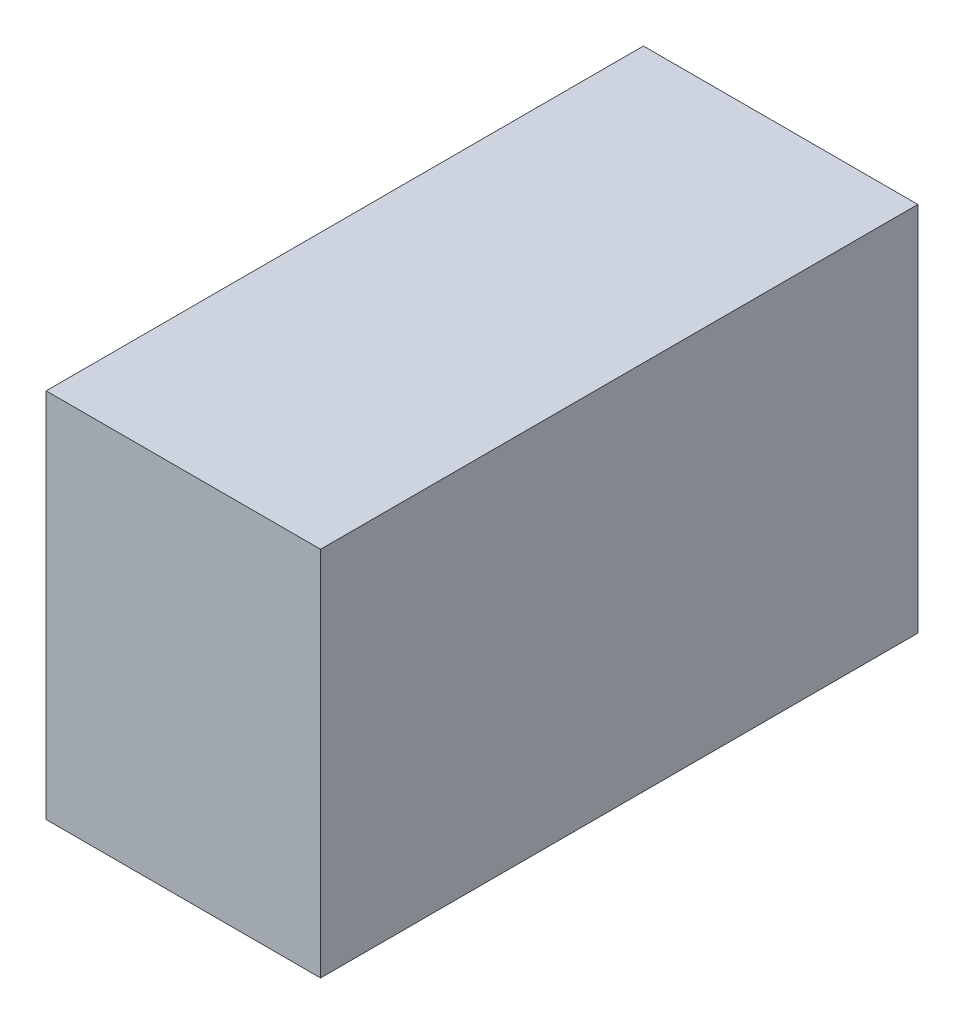
ISO-10303-21;
HEADER;
FILE_DESCRIPTION(('STEP AP214'),'2;1');
FILE_NAME('part.step','',(''),(''),'','','');
FILE_SCHEMA(('AUTOMOTIVE_DESIGN { 1 0 10303 214 1 1 1 1 }'));
ENDSEC;
DATA;
#1=APPLICATION_CONTEXT('core data for automotive mechanical design processes');
#2=APPLICATION_PROTOCOL_DEFINITION('international standard','automotive_design',2000,#1);
#3=PRODUCT_CONTEXT('',#1,'mechanical');
#4=PRODUCT('Part','Part','',(#3));
#5=PRODUCT_RELATED_PRODUCT_CATEGORY('part','',(#4));
#6=PRODUCT_DEFINITION_FORMATION('','',#4);
#7=PRODUCT_DEFINITION_CONTEXT('part definition',#1,'design');
#8=PRODUCT_DEFINITION('design','',#6,#7);
#9=PRODUCT_DEFINITION_SHAPE('','',#8);
#10=(LENGTH_UNIT() NAMED_UNIT(*) SI_UNIT(.MILLI.,.METRE.));
#11=(NAMED_UNIT(*) PLANE_ANGLE_UNIT() SI_UNIT($,.RADIAN.));
#12=(NAMED_UNIT(*) SI_UNIT($,.STERADIAN.) SOLID_ANGLE_UNIT());
#13=UNCERTAINTY_MEASURE_WITH_UNIT(LENGTH_MEASURE(1.E-05),#10,'distance_accuracy_value','');
#14=(GEOMETRIC_REPRESENTATION_CONTEXT(3) GLOBAL_UNCERTAINTY_ASSIGNED_CONTEXT((#13)) GLOBAL_UNIT_ASSIGNED_CONTEXT((#10,
#11,#12)) REPRESENTATION_CONTEXT('',''));
#15=CARTESIAN_POINT('',(0.,0.,0.));
#16=DIRECTION('',(0.,0.,1.));
#17=DIRECTION('',(1.,0.,0.));
#18=AXIS2_PLACEMENT_3D('',#15,#16,#17);
#19=CARTESIAN_POINT('',(-67.75,46.,-79.0875));
#20=DIRECTION('',(-1.,0.,0.));
#21=DIRECTION('',(0.,0.,1.));
#22=AXIS2_PLACEMENT_3D('',#19,#20,#21);
#23=PLANE('',#22);
#24=DIRECTION('',(0.,0.,-1.));
#25=VECTOR('',#24,1.);
#26=CARTESIAN_POINT('',(-67.75,0.,-79.0875));
#27=LINE('',#26,#25);
#28=CARTESIAN_POINT('',(-67.75,0.,-5.08749999999999));
#29=VERTEX_POINT('',#28);
#30=CARTESIAN_POINT('',(-67.75,0.,-79.0875));
#31=VERTEX_POINT('',#30);
#32=EDGE_CURVE('E98',#29,#31,#27,.T.);
#33=ORIENTED_EDGE('',*,*,#32,.T.);
#34=DIRECTION('',(0.,-1.,0.));
#35=VECTOR('',#34,1.);
#36=CARTESIAN_POINT('',(-67.75,46.,-79.0875));
#37=LINE('',#36,#35);
#38=CARTESIAN_POINT('',(-67.75,46.,-79.0875));
#39=VERTEX_POINT('',#38);
#40=EDGE_CURVE('E11',#39,#31,#37,.T.);
#41=ORIENTED_EDGE('',*,*,#40,.F.);
#42=DIRECTION('',(0.,0.,-1.));
#43=VECTOR('',#42,1.);
#44=CARTESIAN_POINT('',(-67.75,46.,-79.0875));
#45=LINE('',#44,#43);
#46=CARTESIAN_POINT('',(-67.75,46.,-5.08749999999999));
#47=VERTEX_POINT('',#46);
#48=EDGE_CURVE('E86',#47,#39,#45,.T.);
#49=ORIENTED_EDGE('',*,*,#48,.F.);
#50=DIRECTION('',(0.,-1.,0.));
#51=VECTOR('',#50,1.);
#52=CARTESIAN_POINT('',(-67.75,46.,-5.08749999999999));
#53=LINE('',#52,#51);
#54=EDGE_CURVE('E94',#47,#29,#53,.T.);
#55=ORIENTED_EDGE('',*,*,#54,.T.);
#56=EDGE_LOOP('',(#33,#41,#49,#55));
#57=FACE_BOUND('',#56,.T.);
#58=ADVANCED_FACE('F35',(#57),#23,.F.);
#59=CARTESIAN_POINT('',(-101.75,46.,-79.0875));
#60=DIRECTION('',(0.,0.,1.));
#61=DIRECTION('',(1.,0.,0.));
#62=AXIS2_PLACEMENT_3D('',#59,#60,#61);
#63=PLANE('',#62);
#64=DIRECTION('',(-1.,0.,0.));
#65=VECTOR('',#64,1.);
#66=CARTESIAN_POINT('',(-101.75,0.,-79.0875));
#67=LINE('',#66,#65);
#68=CARTESIAN_POINT('',(-101.75,0.,-79.0875));
#69=VERTEX_POINT('',#68);
#70=EDGE_CURVE('E90',#31,#69,#67,.T.);
#71=ORIENTED_EDGE('',*,*,#70,.T.);
#72=DIRECTION('',(0.,-1.,0.));
#73=VECTOR('',#72,1.);
#74=CARTESIAN_POINT('',(-101.75,46.,-79.0875));
#75=LINE('',#74,#73);
#76=CARTESIAN_POINT('',(-101.75,46.,-79.0875));
#77=VERTEX_POINT('',#76);
#78=EDGE_CURVE('E43',#77,#69,#75,.T.);
#79=ORIENTED_EDGE('',*,*,#78,.F.);
#80=DIRECTION('',(-1.,0.,0.));
#81=VECTOR('',#80,1.);
#82=CARTESIAN_POINT('',(-101.75,46.,-79.0875));
#83=LINE('',#82,#81);
#84=EDGE_CURVE('E81',#39,#77,#83,.T.);
#85=ORIENTED_EDGE('',*,*,#84,.F.);
#86=ORIENTED_EDGE('',*,*,#40,.T.);
#87=EDGE_LOOP('',(#71,#79,#85,#86));
#88=FACE_BOUND('',#87,.T.);
#89=ADVANCED_FACE('F89',(#88),#63,.F.);
#90=CARTESIAN_POINT('',(-101.75,46.,-79.0875));
#91=DIRECTION('',(1.,0.,0.));
#92=DIRECTION('',(0.,0.,-1.));
#93=AXIS2_PLACEMENT_3D('',#90,#91,#92);
#94=PLANE('',#93);
#95=DIRECTION('',(0.,0.,1.));
#96=VECTOR('',#95,1.);
#97=CARTESIAN_POINT('',(-101.75,0.,-79.0875));
#98=LINE('',#97,#96);
#99=CARTESIAN_POINT('',(-101.75,0.,-5.08749999999999));
#100=VERTEX_POINT('',#99);
#101=EDGE_CURVE('E68',#69,#100,#98,.T.);
#102=ORIENTED_EDGE('',*,*,#101,.T.);
#103=DIRECTION('',(0.,-1.,0.));
#104=VECTOR('',#103,1.);
#105=CARTESIAN_POINT('',(-101.75,46.,-5.08749999999999));
#106=LINE('',#105,#104);
#107=CARTESIAN_POINT('',(-101.75,46.,-5.08749999999999));
#108=VERTEX_POINT('',#107);
#109=EDGE_CURVE('E91',#108,#100,#106,.T.);
#110=ORIENTED_EDGE('',*,*,#109,.F.);
#111=DIRECTION('',(0.,0.,1.));
#112=VECTOR('',#111,1.);
#113=CARTESIAN_POINT('',(-101.75,46.,-79.0875));
#114=LINE('',#113,#112);
#115=EDGE_CURVE('E84',#77,#108,#114,.T.);
#116=ORIENTED_EDGE('',*,*,#115,.F.);
#117=ORIENTED_EDGE('',*,*,#78,.T.);
#118=EDGE_LOOP('',(#102,#110,#116,#117));
#119=FACE_BOUND('',#118,.T.);
#120=ADVANCED_FACE('F92',(#119),#94,.F.);
#121=CARTESIAN_POINT('',(-101.75,46.,-5.08749999999999));
#122=DIRECTION('',(0.,0.,-1.));
#123=DIRECTION('',(-1.,0.,0.));
#124=AXIS2_PLACEMENT_3D('',#121,#122,#123);
#125=PLANE('',#124);
#126=DIRECTION('',(1.,0.,0.));
#127=VECTOR('',#126,1.);
#128=CARTESIAN_POINT('',(-101.75,0.,-5.08749999999999));
#129=LINE('',#128,#127);
#130=EDGE_CURVE('E74',#100,#29,#129,.T.);
#131=ORIENTED_EDGE('',*,*,#130,.T.);
#132=ORIENTED_EDGE('',*,*,#54,.F.);
#133=DIRECTION('',(1.,0.,0.));
#134=VECTOR('',#133,1.);
#135=CARTESIAN_POINT('',(-101.75,46.,-5.08749999999999));
#136=LINE('',#135,#134);
#137=EDGE_CURVE('E51',#108,#47,#136,.T.);
#138=ORIENTED_EDGE('',*,*,#137,.F.);
#139=ORIENTED_EDGE('',*,*,#109,.T.);
#140=EDGE_LOOP('',(#131,#132,#138,#139));
#141=FACE_BOUND('',#140,.T.);
#142=ADVANCED_FACE('F105',(#141),#125,.F.);
#143=CARTESIAN_POINT('',(0.,46.,0.));
#144=DIRECTION('',(0.,1.,0.));
#145=DIRECTION('',(0.,0.,1.));
#146=AXIS2_PLACEMENT_3D('',#143,#144,#145);
#147=PLANE('',#146);
#148=ORIENTED_EDGE('',*,*,#48,.T.);
#149=ORIENTED_EDGE('',*,*,#84,.T.);
#150=ORIENTED_EDGE('',*,*,#115,.T.);
#151=ORIENTED_EDGE('',*,*,#137,.T.);
#152=EDGE_LOOP('',(#148,#149,#150,#151));
#153=FACE_BOUND('',#152,.T.);
#154=ADVANCED_FACE('F82',(#153),#147,.T.);
#155=CARTESIAN_POINT('',(0.,0.,0.));
#156=DIRECTION('',(0.,1.,0.));
#157=DIRECTION('',(0.,0.,1.));
#158=AXIS2_PLACEMENT_3D('',#155,#156,#157);
#159=PLANE('',#158);
#160=ORIENTED_EDGE('',*,*,#32,.F.);
#161=ORIENTED_EDGE('',*,*,#130,.F.);
#162=ORIENTED_EDGE('',*,*,#101,.F.);
#163=ORIENTED_EDGE('',*,*,#70,.F.);
#164=EDGE_LOOP('',(#160,#161,#162,#163));
#165=FACE_BOUND('',#164,.T.);
#166=ADVANCED_FACE('F108',(#165),#159,.F.);
#167=CLOSED_SHELL('',(#58,#89,#120,#142,#154,#166));
#168=MANIFOLD_SOLID_BREP('B2',#167);
#169=ADVANCED_BREP_SHAPE_REPRESENTATION('',(#18,#168),#14);
#170=SHAPE_DEFINITION_REPRESENTATION(#9,#169);
ENDSEC;
END-ISO-10303-21;
